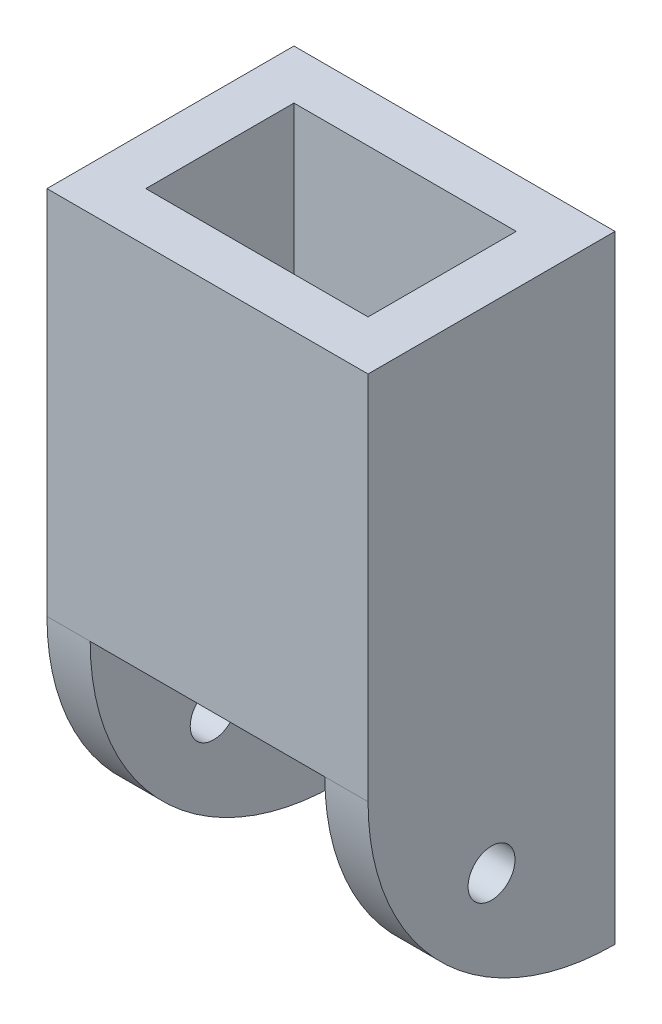
ISO-10303-21;
HEADER;
FILE_DESCRIPTION(('STEP AP214'),'2;1');
FILE_NAME('part.step','',(''),(''),'','','');
FILE_SCHEMA(('AUTOMOTIVE_DESIGN { 1 0 10303 214 1 1 1 1 }'));
ENDSEC;
DATA;
#1=APPLICATION_CONTEXT('core data for automotive mechanical design processes');
#2=APPLICATION_PROTOCOL_DEFINITION('international standard','automotive_design',2000,#1);
#3=PRODUCT_CONTEXT('',#1,'mechanical');
#4=PRODUCT('Part','Part','',(#3));
#5=PRODUCT_RELATED_PRODUCT_CATEGORY('part','',(#4));
#6=PRODUCT_DEFINITION_FORMATION('','',#4);
#7=PRODUCT_DEFINITION_CONTEXT('part definition',#1,'design');
#8=PRODUCT_DEFINITION('design','',#6,#7);
#9=PRODUCT_DEFINITION_SHAPE('','',#8);
#10=(LENGTH_UNIT() NAMED_UNIT(*) SI_UNIT(.MILLI.,.METRE.));
#11=(NAMED_UNIT(*) PLANE_ANGLE_UNIT() SI_UNIT($,.RADIAN.));
#12=(NAMED_UNIT(*) SI_UNIT($,.STERADIAN.) SOLID_ANGLE_UNIT());
#13=UNCERTAINTY_MEASURE_WITH_UNIT(LENGTH_MEASURE(1.E-05),#10,'distance_accuracy_value','');
#14=(GEOMETRIC_REPRESENTATION_CONTEXT(3) GLOBAL_UNCERTAINTY_ASSIGNED_CONTEXT((#13)) GLOBAL_UNIT_ASSIGNED_CONTEXT((#10,
#11,#12)) REPRESENTATION_CONTEXT('',''));
#15=CARTESIAN_POINT('',(0.,0.,0.));
#16=DIRECTION('',(0.,0.,1.));
#17=DIRECTION('',(1.,0.,0.));
#18=AXIS2_PLACEMENT_3D('',#15,#16,#17);
#19=CARTESIAN_POINT('',(0.,0.,0.));
#20=DIRECTION('',(0.,-1.,0.));
#21=DIRECTION('',(0.,0.,-1.));
#22=AXIS2_PLACEMENT_3D('',#19,#20,#21);
#23=PLANE('',#22);
#24=DIRECTION('',(0.,0.,1.));
#25=VECTOR('',#24,1.);
#26=CARTESIAN_POINT('',(4.,0.,3.6));
#27=LINE('',#26,#25);
#28=CARTESIAN_POINT('',(4.,0.,3.6));
#29=VERTEX_POINT('',#28);
#30=CARTESIAN_POINT('',(4.,0.,4.4));
#31=VERTEX_POINT('',#30);
#32=EDGE_CURVE('E67',#29,#31,#27,.T.);
#33=ORIENTED_EDGE('',*,*,#32,.F.);
#34=DIRECTION('',(1.,0.,0.));
#35=VECTOR('',#34,1.);
#36=CARTESIAN_POINT('',(-4.,0.,3.6));
#37=LINE('',#36,#35);
#38=CARTESIAN_POINT('',(-4.,0.,3.6));
#39=VERTEX_POINT('',#38);
#40=EDGE_CURVE('E230',#39,#29,#37,.T.);
#41=ORIENTED_EDGE('',*,*,#40,.F.);
#42=DIRECTION('',(0.,0.,-1.));
#43=VECTOR('',#42,1.);
#44=CARTESIAN_POINT('',(-4.,0.,3.6));
#45=LINE('',#44,#43);
#46=CARTESIAN_POINT('',(-4.,0.,4.4));
#47=VERTEX_POINT('',#46);
#48=EDGE_CURVE('E249',#47,#39,#45,.T.);
#49=ORIENTED_EDGE('',*,*,#48,.F.);
#50=DIRECTION('',(-1.,0.,0.));
#51=VECTOR('',#50,1.);
#52=CARTESIAN_POINT('',(-4.,0.,4.4));
#53=LINE('',#52,#51);
#54=EDGE_CURVE('E245',#31,#47,#53,.T.);
#55=ORIENTED_EDGE('',*,*,#54,.F.);
#56=EDGE_LOOP('',(#33,#41,#49,#55));
#57=FACE_BOUND('',#56,.T.);
#58=DIRECTION('',(1.,0.,0.));
#59=VECTOR('',#58,1.);
#60=CARTESIAN_POINT('',(-4.5,0.,3.));
#61=LINE('',#60,#59);
#62=CARTESIAN_POINT('',(-4.5,0.,3.));
#63=VERTEX_POINT('',#62);
#64=CARTESIAN_POINT('',(4.5,0.,3.));
#65=VERTEX_POINT('',#64);
#66=EDGE_CURVE('E329',#63,#65,#61,.T.);
#67=ORIENTED_EDGE('',*,*,#66,.T.);
#68=DIRECTION('',(0.,0.,1.));
#69=VECTOR('',#68,1.);
#70=CARTESIAN_POINT('',(4.5,0.,-5.));
#71=LINE('',#70,#69);
#72=CARTESIAN_POINT('',(4.5,0.,-3.));
#73=VERTEX_POINT('',#72);
#74=EDGE_CURVE('E273',#73,#65,#71,.T.);
#75=ORIENTED_EDGE('',*,*,#74,.F.);
#76=DIRECTION('',(-1.,0.,0.));
#77=VECTOR('',#76,1.);
#78=CARTESIAN_POINT('',(-4.5,0.,-3.));
#79=LINE('',#78,#77);
#80=CARTESIAN_POINT('',(-4.5,0.,-3.));
#81=VERTEX_POINT('',#80);
#82=EDGE_CURVE('E320',#73,#81,#79,.T.);
#83=ORIENTED_EDGE('',*,*,#82,.T.);
#84=DIRECTION('',(0.,0.,1.));
#85=VECTOR('',#84,1.);
#86=CARTESIAN_POINT('',(-4.5,0.,-5.));
#87=LINE('',#86,#85);
#88=EDGE_CURVE('E272',#81,#63,#87,.T.);
#89=ORIENTED_EDGE('',*,*,#88,.T.);
#90=EDGE_LOOP('',(#67,#75,#83,#89));
#91=FACE_BOUND('',#90,.T.);
#92=DIRECTION('',(1.,0.,0.));
#93=VECTOR('',#92,1.);
#94=CARTESIAN_POINT('',(4.5,0.,5.));
#95=LINE('',#94,#93);
#96=CARTESIAN_POINT('',(-4.75,0.,5.));
#97=VERTEX_POINT('',#96);
#98=CARTESIAN_POINT('',(4.75,0.,5.));
#99=VERTEX_POINT('',#98);
#100=EDGE_CURVE('E321',#97,#99,#95,.T.);
#101=ORIENTED_EDGE('',*,*,#100,.F.);
#102=DIRECTION('',(0.,0.,1.));
#103=VECTOR('',#102,1.);
#104=CARTESIAN_POINT('',(-4.75,0.,-5.));
#105=LINE('',#104,#103);
#106=CARTESIAN_POINT('',(-4.75,0.,-5.));
#107=VERTEX_POINT('',#106);
#108=EDGE_CURVE('E274',#107,#97,#105,.T.);
#109=ORIENTED_EDGE('',*,*,#108,.F.);
#110=DIRECTION('',(-1.,0.,0.));
#111=VECTOR('',#110,1.);
#112=CARTESIAN_POINT('',(-6.5,0.,-5.));
#113=LINE('',#112,#111);
#114=CARTESIAN_POINT('',(4.75,0.,-5.));
#115=VERTEX_POINT('',#114);
#116=EDGE_CURVE('E361',#115,#107,#113,.T.);
#117=ORIENTED_EDGE('',*,*,#116,.F.);
#118=DIRECTION('',(0.,0.,1.));
#119=VECTOR('',#118,1.);
#120=CARTESIAN_POINT('',(4.75,0.,-5.));
#121=LINE('',#120,#119);
#122=EDGE_CURVE('E284',#115,#99,#121,.T.);
#123=ORIENTED_EDGE('',*,*,#122,.T.);
#124=EDGE_LOOP('',(#101,#109,#117,#123));
#125=FACE_BOUND('',#124,.T.);
#126=DIRECTION('',(1.,0.,0.));
#127=VECTOR('',#126,1.);
#128=CARTESIAN_POINT('',(-4.,0.,-3.6));
#129=LINE('',#128,#127);
#130=CARTESIAN_POINT('',(-4.,0.,-3.6));
#131=VERTEX_POINT('',#130);
#132=CARTESIAN_POINT('',(4.,0.,-3.6));
#133=VERTEX_POINT('',#132);
#134=EDGE_CURVE('E211',#131,#133,#129,.T.);
#135=ORIENTED_EDGE('',*,*,#134,.T.);
#136=DIRECTION('',(0.,0.,-1.));
#137=VECTOR('',#136,1.);
#138=CARTESIAN_POINT('',(4.,0.,-3.6));
#139=LINE('',#138,#137);
#140=CARTESIAN_POINT('',(4.,0.,-4.4));
#141=VERTEX_POINT('',#140);
#142=EDGE_CURVE('E59',#133,#141,#139,.T.);
#143=ORIENTED_EDGE('',*,*,#142,.T.);
#144=DIRECTION('',(-1.,0.,0.));
#145=VECTOR('',#144,1.);
#146=CARTESIAN_POINT('',(-4.,0.,-4.4));
#147=LINE('',#146,#145);
#148=CARTESIAN_POINT('',(-4.,0.,-4.4));
#149=VERTEX_POINT('',#148);
#150=EDGE_CURVE('E198',#141,#149,#147,.T.);
#151=ORIENTED_EDGE('',*,*,#150,.T.);
#152=DIRECTION('',(0.,0.,1.));
#153=VECTOR('',#152,1.);
#154=CARTESIAN_POINT('',(-4.,0.,-3.6));
#155=LINE('',#154,#153);
#156=EDGE_CURVE('E202',#149,#131,#155,.T.);
#157=ORIENTED_EDGE('',*,*,#156,.T.);
#158=EDGE_LOOP('',(#135,#143,#151,#157));
#159=FACE_BOUND('',#158,.T.);
#160=ADVANCED_FACE('F41',(#57,#91,#125,#159),#23,.T.);
#161=CARTESIAN_POINT('',(0.,15.,0.));
#162=DIRECTION('',(0.,-1.,0.));
#163=DIRECTION('',(0.,0.,-1.));
#164=AXIS2_PLACEMENT_3D('',#161,#162,#163);
#165=PLANE('',#164);
#166=DIRECTION('',(0.,0.,-1.));
#167=VECTOR('',#166,1.);
#168=CARTESIAN_POINT('',(6.5,15.,5.));
#169=LINE('',#168,#167);
#170=CARTESIAN_POINT('',(6.5,15.,5.));
#171=VERTEX_POINT('',#170);
#172=CARTESIAN_POINT('',(6.5,15.,-5.));
#173=VERTEX_POINT('',#172);
#174=EDGE_CURVE('E362',#171,#173,#169,.T.);
#175=ORIENTED_EDGE('',*,*,#174,.T.);
#176=DIRECTION('',(-1.,0.,0.));
#177=VECTOR('',#176,1.);
#178=CARTESIAN_POINT('',(-6.5,15.,-5.));
#179=LINE('',#178,#177);
#180=CARTESIAN_POINT('',(-6.5,15.,-5.));
#181=VERTEX_POINT('',#180);
#182=EDGE_CURVE('E366',#173,#181,#179,.T.);
#183=ORIENTED_EDGE('',*,*,#182,.T.);
#184=DIRECTION('',(0.,0.,1.));
#185=VECTOR('',#184,1.);
#186=CARTESIAN_POINT('',(-6.5,15.,5.));
#187=LINE('',#186,#185);
#188=CARTESIAN_POINT('',(-6.5,15.,5.));
#189=VERTEX_POINT('',#188);
#190=EDGE_CURVE('E370',#181,#189,#187,.T.);
#191=ORIENTED_EDGE('',*,*,#190,.T.);
#192=DIRECTION('',(1.,0.,0.));
#193=VECTOR('',#192,1.);
#194=CARTESIAN_POINT('',(-6.5,15.,5.));
#195=LINE('',#194,#193);
#196=EDGE_CURVE('E373',#189,#171,#195,.T.);
#197=ORIENTED_EDGE('',*,*,#196,.T.);
#198=EDGE_LOOP('',(#175,#183,#191,#197));
#199=FACE_BOUND('',#198,.T.);
#200=DIRECTION('',(0.,0.,-1.));
#201=VECTOR('',#200,1.);
#202=CARTESIAN_POINT('',(4.5,15.,3.));
#203=LINE('',#202,#201);
#204=CARTESIAN_POINT('',(4.5,15.,3.));
#205=VERTEX_POINT('',#204);
#206=CARTESIAN_POINT('',(4.5,15.,-3.));
#207=VERTEX_POINT('',#206);
#208=EDGE_CURVE('E325',#205,#207,#203,.T.);
#209=ORIENTED_EDGE('',*,*,#208,.F.);
#210=DIRECTION('',(1.,0.,0.));
#211=VECTOR('',#210,1.);
#212=CARTESIAN_POINT('',(-4.5,15.,3.));
#213=LINE('',#212,#211);
#214=CARTESIAN_POINT('',(-4.5,15.,3.));
#215=VERTEX_POINT('',#214);
#216=EDGE_CURVE('E336',#215,#205,#213,.T.);
#217=ORIENTED_EDGE('',*,*,#216,.F.);
#218=DIRECTION('',(0.,0.,1.));
#219=VECTOR('',#218,1.);
#220=CARTESIAN_POINT('',(-4.5,15.,3.));
#221=LINE('',#220,#219);
#222=CARTESIAN_POINT('',(-4.5,15.,-3.));
#223=VERTEX_POINT('',#222);
#224=EDGE_CURVE('E332',#223,#215,#221,.T.);
#225=ORIENTED_EDGE('',*,*,#224,.F.);
#226=DIRECTION('',(-1.,0.,0.));
#227=VECTOR('',#226,1.);
#228=CARTESIAN_POINT('',(-4.5,15.,-3.));
#229=LINE('',#228,#227);
#230=EDGE_CURVE('E328',#207,#223,#229,.T.);
#231=ORIENTED_EDGE('',*,*,#230,.F.);
#232=EDGE_LOOP('',(#209,#217,#225,#231));
#233=FACE_BOUND('',#232,.T.);
#234=ADVANCED_FACE('F412',(#199,#233),#165,.F.);
#235=CARTESIAN_POINT('',(6.5,15.,5.));
#236=DIRECTION('',(-1.,0.,0.));
#237=DIRECTION('',(0.,0.,1.));
#238=AXIS2_PLACEMENT_3D('',#235,#236,#237);
#239=PLANE('',#238);
#240=CARTESIAN_POINT('',(6.5,-5.,0.));
#241=DIRECTION('',(1.,0.,0.));
#242=DIRECTION('',(0.,0.,-1.));
#243=AXIS2_PLACEMENT_3D('',#240,#241,#242);
#244=CIRCLE('',#243,0.95);
#245=CARTESIAN_POINT('',(6.5,-5.,-0.949999999999999));
#246=VERTEX_POINT('',#245);
#247=EDGE_CURVE('E297',#246,#246,#244,.T.);
#248=ORIENTED_EDGE('',*,*,#247,.F.);
#249=EDGE_LOOP('',(#248));
#250=FACE_BOUND('',#249,.T.);
#251=DIRECTION('',(0.,-1.,0.));
#252=VECTOR('',#251,1.);
#253=CARTESIAN_POINT('',(6.5,15.,5.));
#254=LINE('',#253,#252);
#255=CARTESIAN_POINT('',(6.5,0.,5.));
#256=VERTEX_POINT('',#255);
#257=EDGE_CURVE('E376',#171,#256,#254,.T.);
#258=ORIENTED_EDGE('',*,*,#257,.T.);
#259=CARTESIAN_POINT('',(6.5,0.,-5.));
#260=DIRECTION('',(1.,0.,0.));
#261=DIRECTION('',(0.,0.,-1.));
#262=AXIS2_PLACEMENT_3D('',#259,#260,#261);
#263=CIRCLE('',#262,10.);
#264=CARTESIAN_POINT('',(6.5,-10.,-5.));
#265=VERTEX_POINT('',#264);
#266=EDGE_CURVE('E312',#256,#265,#263,.T.);
#267=ORIENTED_EDGE('',*,*,#266,.T.);
#268=DIRECTION('',(0.,-1.,0.));
#269=VECTOR('',#268,1.);
#270=CARTESIAN_POINT('',(6.5,15.,-5.));
#271=LINE('',#270,#269);
#272=EDGE_CURVE('E11',#173,#265,#271,.T.);
#273=ORIENTED_EDGE('',*,*,#272,.F.);
#274=ORIENTED_EDGE('',*,*,#174,.F.);
#275=EDGE_LOOP('',(#258,#267,#273,#274));
#276=FACE_BOUND('',#275,.T.);
#277=ADVANCED_FACE('F43',(#250,#276),#239,.F.);
#278=CARTESIAN_POINT('',(-6.5,15.,-5.));
#279=DIRECTION('',(0.,0.,1.));
#280=DIRECTION('',(1.,0.,0.));
#281=AXIS2_PLACEMENT_3D('',#278,#279,#280);
#282=PLANE('',#281);
#283=ORIENTED_EDGE('',*,*,#116,.T.);
#284=DIRECTION('',(0.,-1.,0.));
#285=VECTOR('',#284,1.);
#286=CARTESIAN_POINT('',(-4.75,-10.,-5.));
#287=LINE('',#286,#285);
#288=CARTESIAN_POINT('',(-4.75,-10.,-5.));
#289=VERTEX_POINT('',#288);
#290=EDGE_CURVE('E268',#107,#289,#287,.T.);
#291=ORIENTED_EDGE('',*,*,#290,.T.);
#292=DIRECTION('',(-1.,0.,0.));
#293=VECTOR('',#292,1.);
#294=CARTESIAN_POINT('',(-4.5,-10.,-5.));
#295=LINE('',#294,#293);
#296=CARTESIAN_POINT('',(-6.5,-10.,-5.));
#297=VERTEX_POINT('',#296);
#298=EDGE_CURVE('E309',#289,#297,#295,.T.);
#299=ORIENTED_EDGE('',*,*,#298,.T.);
#300=DIRECTION('',(0.,-1.,0.));
#301=VECTOR('',#300,1.);
#302=CARTESIAN_POINT('',(-6.5,15.,-5.));
#303=LINE('',#302,#301);
#304=EDGE_CURVE('E51',#181,#297,#303,.T.);
#305=ORIENTED_EDGE('',*,*,#304,.F.);
#306=ORIENTED_EDGE('',*,*,#182,.F.);
#307=ORIENTED_EDGE('',*,*,#272,.T.);
#308=DIRECTION('',(1.,0.,0.));
#309=VECTOR('',#308,1.);
#310=CARTESIAN_POINT('',(4.5,-10.,-5.));
#311=LINE('',#310,#309);
#312=CARTESIAN_POINT('',(4.75,-10.,-5.));
#313=VERTEX_POINT('',#312);
#314=EDGE_CURVE('E317',#313,#265,#311,.T.);
#315=ORIENTED_EDGE('',*,*,#314,.F.);
#316=DIRECTION('',(0.,1.,0.));
#317=VECTOR('',#316,1.);
#318=CARTESIAN_POINT('',(4.75,-10.,-5.));
#319=LINE('',#318,#317);
#320=EDGE_CURVE('E259',#313,#115,#319,.T.);
#321=ORIENTED_EDGE('',*,*,#320,.T.);
#322=EDGE_LOOP('',(#283,#291,#299,#305,#306,#307,#315,#321));
#323=FACE_BOUND('',#322,.T.);
#324=ADVANCED_FACE('F430',(#323),#282,.F.);
#325=CARTESIAN_POINT('',(-6.5,15.,5.));
#326=DIRECTION('',(1.,0.,0.));
#327=DIRECTION('',(0.,0.,-1.));
#328=AXIS2_PLACEMENT_3D('',#325,#326,#327);
#329=PLANE('',#328);
#330=CARTESIAN_POINT('',(-6.5,-5.,0.));
#331=DIRECTION('',(1.,0.,0.));
#332=DIRECTION('',(0.,0.,-1.));
#333=AXIS2_PLACEMENT_3D('',#330,#331,#332);
#334=CIRCLE('',#333,0.95);
#335=CARTESIAN_POINT('',(-6.5,-5.,-0.949999999999999));
#336=VERTEX_POINT('',#335);
#337=EDGE_CURVE('E298',#336,#336,#334,.T.);
#338=ORIENTED_EDGE('',*,*,#337,.T.);
#339=EDGE_LOOP('',(#338));
#340=FACE_BOUND('',#339,.T.);
#341=ORIENTED_EDGE('',*,*,#304,.T.);
#342=CARTESIAN_POINT('',(-6.5,0.,-5.));
#343=DIRECTION('',(1.,0.,0.));
#344=DIRECTION('',(0.,0.,-1.));
#345=AXIS2_PLACEMENT_3D('',#342,#343,#344);
#346=CIRCLE('',#345,10.);
#347=CARTESIAN_POINT('',(-6.5,0.,5.));
#348=VERTEX_POINT('',#347);
#349=EDGE_CURVE('E302',#348,#297,#346,.T.);
#350=ORIENTED_EDGE('',*,*,#349,.F.);
#351=DIRECTION('',(0.,-1.,0.));
#352=VECTOR('',#351,1.);
#353=CARTESIAN_POINT('',(-6.5,15.,5.));
#354=LINE('',#353,#352);
#355=EDGE_CURVE('E385',#189,#348,#354,.T.);
#356=ORIENTED_EDGE('',*,*,#355,.F.);
#357=ORIENTED_EDGE('',*,*,#190,.F.);
#358=EDGE_LOOP('',(#341,#350,#356,#357));
#359=FACE_BOUND('',#358,.T.);
#360=ADVANCED_FACE('F427',(#340,#359),#329,.F.);
#361=CARTESIAN_POINT('',(-6.5,15.,5.));
#362=DIRECTION('',(0.,0.,-1.));
#363=DIRECTION('',(-1.,0.,0.));
#364=AXIS2_PLACEMENT_3D('',#361,#362,#363);
#365=PLANE('',#364);
#366=DIRECTION('',(1.,0.,0.));
#367=VECTOR('',#366,1.);
#368=CARTESIAN_POINT('',(-6.5,0.,5.));
#369=LINE('',#368,#367);
#370=EDGE_CURVE('E367',#348,#97,#369,.T.);
#371=ORIENTED_EDGE('',*,*,#370,.T.);
#372=ORIENTED_EDGE('',*,*,#100,.T.);
#373=EDGE_CURVE('E316',#99,#256,#95,.T.);
#374=ORIENTED_EDGE('',*,*,#373,.T.);
#375=ORIENTED_EDGE('',*,*,#257,.F.);
#376=ORIENTED_EDGE('',*,*,#196,.F.);
#377=ORIENTED_EDGE('',*,*,#355,.T.);
#378=EDGE_LOOP('',(#371,#372,#374,#375,#376,#377));
#379=FACE_BOUND('',#378,.T.);
#380=ADVANCED_FACE('F423',(#379),#365,.F.);
#381=CARTESIAN_POINT('',(4.5,15.,3.));
#382=DIRECTION('',(-1.,0.,0.));
#383=DIRECTION('',(0.,0.,1.));
#384=AXIS2_PLACEMENT_3D('',#381,#382,#383);
#385=PLANE('',#384);
#386=ORIENTED_EDGE('',*,*,#74,.T.);
#387=DIRECTION('',(0.,-1.,0.));
#388=VECTOR('',#387,1.);
#389=CARTESIAN_POINT('',(4.5,15.,3.));
#390=LINE('',#389,#388);
#391=EDGE_CURVE('E339',#205,#65,#390,.T.);
#392=ORIENTED_EDGE('',*,*,#391,.F.);
#393=ORIENTED_EDGE('',*,*,#208,.T.);
#394=DIRECTION('',(0.,-1.,0.));
#395=VECTOR('',#394,1.);
#396=CARTESIAN_POINT('',(4.5,15.,-3.));
#397=LINE('',#396,#395);
#398=EDGE_CURVE('E357',#207,#73,#397,.T.);
#399=ORIENTED_EDGE('',*,*,#398,.T.);
#400=EDGE_LOOP('',(#386,#392,#393,#399));
#401=FACE_BOUND('',#400,.T.);
#402=ADVANCED_FACE('F426',(#401),#385,.T.);
#403=CARTESIAN_POINT('',(-4.5,15.,-3.));
#404=DIRECTION('',(0.,0.,1.));
#405=DIRECTION('',(1.,0.,0.));
#406=AXIS2_PLACEMENT_3D('',#403,#404,#405);
#407=PLANE('',#406);
#408=ORIENTED_EDGE('',*,*,#82,.F.);
#409=ORIENTED_EDGE('',*,*,#398,.F.);
#410=ORIENTED_EDGE('',*,*,#230,.T.);
#411=DIRECTION('',(0.,-1.,0.));
#412=VECTOR('',#411,1.);
#413=CARTESIAN_POINT('',(-4.5,15.,-3.));
#414=LINE('',#413,#412);
#415=EDGE_CURVE('E353',#223,#81,#414,.T.);
#416=ORIENTED_EDGE('',*,*,#415,.T.);
#417=EDGE_LOOP('',(#408,#409,#410,#416));
#418=FACE_BOUND('',#417,.T.);
#419=ADVANCED_FACE('F487',(#418),#407,.T.);
#420=CARTESIAN_POINT('',(-4.5,15.,3.));
#421=DIRECTION('',(1.,0.,0.));
#422=DIRECTION('',(0.,0.,-1.));
#423=AXIS2_PLACEMENT_3D('',#420,#421,#422);
#424=PLANE('',#423);
#425=ORIENTED_EDGE('',*,*,#88,.F.);
#426=ORIENTED_EDGE('',*,*,#415,.F.);
#427=ORIENTED_EDGE('',*,*,#224,.T.);
#428=DIRECTION('',(0.,-1.,0.));
#429=VECTOR('',#428,1.);
#430=CARTESIAN_POINT('',(-4.5,15.,3.));
#431=LINE('',#430,#429);
#432=EDGE_CURVE('E349',#215,#63,#431,.T.);
#433=ORIENTED_EDGE('',*,*,#432,.T.);
#434=EDGE_LOOP('',(#425,#426,#427,#433));
#435=FACE_BOUND('',#434,.T.);
#436=ADVANCED_FACE('F483',(#435),#424,.T.);
#437=CARTESIAN_POINT('',(-4.5,15.,3.));
#438=DIRECTION('',(0.,0.,-1.));
#439=DIRECTION('',(-1.,0.,0.));
#440=AXIS2_PLACEMENT_3D('',#437,#438,#439);
#441=PLANE('',#440);
#442=ORIENTED_EDGE('',*,*,#66,.F.);
#443=ORIENTED_EDGE('',*,*,#432,.F.);
#444=ORIENTED_EDGE('',*,*,#216,.T.);
#445=ORIENTED_EDGE('',*,*,#391,.T.);
#446=EDGE_LOOP('',(#442,#443,#444,#445));
#447=FACE_BOUND('',#446,.T.);
#448=ADVANCED_FACE('F480',(#447),#441,.T.);
#449=CARTESIAN_POINT('',(4.5,0.,-5.));
#450=DIRECTION('',(1.,0.,0.));
#451=DIRECTION('',(0.,0.,-1.));
#452=AXIS2_PLACEMENT_3D('',#449,#450,#451);
#453=CYLINDRICAL_SURFACE('',#452,10.);
#454=CARTESIAN_POINT('',(4.75,0.,-5.));
#455=DIRECTION('',(1.,0.,0.));
#456=DIRECTION('',(0.,0.,-1.));
#457=AXIS2_PLACEMENT_3D('',#454,#455,#456);
#458=CIRCLE('',#457,10.);
#459=EDGE_CURVE('E289',#313,#99,#458,.F.);
#460=ORIENTED_EDGE('',*,*,#459,.F.);
#461=ORIENTED_EDGE('',*,*,#314,.T.);
#462=ORIENTED_EDGE('',*,*,#266,.F.);
#463=ORIENTED_EDGE('',*,*,#373,.F.);
#464=EDGE_LOOP('',(#460,#461,#462,#463));
#465=FACE_BOUND('',#464,.T.);
#466=ADVANCED_FACE('F464',(#465),#453,.T.);
#467=CARTESIAN_POINT('',(-4.5,0.,-5.));
#468=DIRECTION('',(-1.,0.,0.));
#469=DIRECTION('',(0.,0.,1.));
#470=AXIS2_PLACEMENT_3D('',#467,#468,#469);
#471=CYLINDRICAL_SURFACE('',#470,10.);
#472=ORIENTED_EDGE('',*,*,#298,.F.);
#473=CARTESIAN_POINT('',(-4.75,0.,-5.));
#474=DIRECTION('',(-1.,0.,0.));
#475=DIRECTION('',(0.,0.,1.));
#476=AXIS2_PLACEMENT_3D('',#473,#474,#475);
#477=CIRCLE('',#476,10.);
#478=EDGE_CURVE('E293',#289,#97,#477,.T.);
#479=ORIENTED_EDGE('',*,*,#478,.T.);
#480=ORIENTED_EDGE('',*,*,#370,.F.);
#481=ORIENTED_EDGE('',*,*,#349,.T.);
#482=EDGE_LOOP('',(#472,#479,#480,#481));
#483=FACE_BOUND('',#482,.T.);
#484=ADVANCED_FACE('F448',(#483),#471,.T.);
#485=CARTESIAN_POINT('',(-6.5,-5.,0.));
#486=DIRECTION('',(1.,0.,0.));
#487=DIRECTION('',(0.,0.,-1.));
#488=AXIS2_PLACEMENT_3D('',#485,#486,#487);
#489=CYLINDRICAL_SURFACE('',#488,0.95);
#490=CARTESIAN_POINT('',(-4.75,-5.,0.));
#491=DIRECTION('',(-1.,0.,0.));
#492=DIRECTION('',(0.,0.,1.));
#493=AXIS2_PLACEMENT_3D('',#490,#491,#492);
#494=CIRCLE('',#493,0.95);
#495=CARTESIAN_POINT('',(-4.75,-5.,0.950000000000001));
#496=VERTEX_POINT('',#495);
#497=EDGE_CURVE('E45',#496,#496,#494,.F.);
#498=ORIENTED_EDGE('',*,*,#497,.T.);
#499=EDGE_LOOP('',(#498));
#500=FACE_BOUND('',#499,.T.);
#501=ORIENTED_EDGE('',*,*,#337,.F.);
#502=EDGE_LOOP('',(#501));
#503=FACE_BOUND('',#502,.T.);
#504=ADVANCED_FACE('F409',(#500,#503),#489,.F.);
#505=CARTESIAN_POINT('',(4.75,-5.,0.));
#506=DIRECTION('',(1.,0.,0.));
#507=DIRECTION('',(0.,0.,-1.));
#508=AXIS2_PLACEMENT_3D('',#505,#506,#507);
#509=CIRCLE('',#508,0.95);
#510=CARTESIAN_POINT('',(4.75,-5.,-0.949999999999999));
#511=VERTEX_POINT('',#510);
#512=EDGE_CURVE('E278',#511,#511,#509,.F.);
#513=ORIENTED_EDGE('',*,*,#512,.T.);
#514=EDGE_LOOP('',(#513));
#515=FACE_BOUND('',#514,.T.);
#516=ORIENTED_EDGE('',*,*,#247,.T.);
#517=EDGE_LOOP('',(#516));
#518=FACE_BOUND('',#517,.T.);
#519=ADVANCED_FACE('F394',(#515,#518),#489,.F.);
#520=CARTESIAN_POINT('',(4.75,-10.,-5.));
#521=DIRECTION('',(1.,0.,0.));
#522=DIRECTION('',(0.,0.,-1.));
#523=AXIS2_PLACEMENT_3D('',#520,#521,#522);
#524=PLANE('',#523);
#525=ORIENTED_EDGE('',*,*,#459,.T.);
#526=ORIENTED_EDGE('',*,*,#122,.F.);
#527=ORIENTED_EDGE('',*,*,#320,.F.);
#528=EDGE_LOOP('',(#525,#526,#527));
#529=FACE_BOUND('',#528,.T.);
#530=ORIENTED_EDGE('',*,*,#512,.F.);
#531=EDGE_LOOP('',(#530));
#532=FACE_BOUND('',#531,.T.);
#533=ADVANCED_FACE('F397',(#529,#532),#524,.F.);
#534=CARTESIAN_POINT('',(-4.75,-10.,-5.));
#535=DIRECTION('',(-1.,0.,0.));
#536=DIRECTION('',(0.,0.,1.));
#537=AXIS2_PLACEMENT_3D('',#534,#535,#536);
#538=PLANE('',#537);
#539=ORIENTED_EDGE('',*,*,#497,.F.);
#540=EDGE_LOOP('',(#539));
#541=FACE_BOUND('',#540,.T.);
#542=ORIENTED_EDGE('',*,*,#290,.F.);
#543=ORIENTED_EDGE('',*,*,#108,.T.);
#544=ORIENTED_EDGE('',*,*,#478,.F.);
#545=EDGE_LOOP('',(#542,#543,#544));
#546=FACE_BOUND('',#545,.T.);
#547=ADVANCED_FACE('F399',(#541,#546),#538,.F.);
#548=CARTESIAN_POINT('',(4.,10.,3.6));
#549=DIRECTION('',(1.,0.,0.));
#550=DIRECTION('',(0.,0.,-1.));
#551=AXIS2_PLACEMENT_3D('',#548,#549,#550);
#552=PLANE('',#551);
#553=ORIENTED_EDGE('',*,*,#32,.T.);
#554=DIRECTION('',(0.,-1.,0.));
#555=VECTOR('',#554,1.);
#556=CARTESIAN_POINT('',(4.,10.,4.4));
#557=LINE('',#556,#555);
#558=CARTESIAN_POINT('',(4.,10.,4.4));
#559=VERTEX_POINT('',#558);
#560=EDGE_CURVE('E242',#559,#31,#557,.T.);
#561=ORIENTED_EDGE('',*,*,#560,.F.);
#562=DIRECTION('',(0.,0.,1.));
#563=VECTOR('',#562,1.);
#564=CARTESIAN_POINT('',(4.,10.,3.6));
#565=LINE('',#564,#563);
#566=CARTESIAN_POINT('',(4.,10.,3.6));
#567=VERTEX_POINT('',#566);
#568=EDGE_CURVE('E225',#567,#559,#565,.T.);
#569=ORIENTED_EDGE('',*,*,#568,.F.);
#570=DIRECTION('',(0.,-1.,0.));
#571=VECTOR('',#570,1.);
#572=CARTESIAN_POINT('',(4.,10.,3.6));
#573=LINE('',#572,#571);
#574=EDGE_CURVE('E256',#567,#29,#573,.T.);
#575=ORIENTED_EDGE('',*,*,#574,.T.);
#576=EDGE_LOOP('',(#553,#561,#569,#575));
#577=FACE_BOUND('',#576,.T.);
#578=ADVANCED_FACE('F406',(#577),#552,.F.);
#579=CARTESIAN_POINT('',(-4.,10.,3.6));
#580=DIRECTION('',(0.,0.,-1.));
#581=DIRECTION('',(-1.,0.,0.));
#582=AXIS2_PLACEMENT_3D('',#579,#580,#581);
#583=PLANE('',#582);
#584=ORIENTED_EDGE('',*,*,#40,.T.);
#585=ORIENTED_EDGE('',*,*,#574,.F.);
#586=DIRECTION('',(1.,0.,0.));
#587=VECTOR('',#586,1.);
#588=CARTESIAN_POINT('',(-4.,10.,3.6));
#589=LINE('',#588,#587);
#590=CARTESIAN_POINT('',(-4.,10.,3.6));
#591=VERTEX_POINT('',#590);
#592=EDGE_CURVE('E238',#591,#567,#589,.T.);
#593=ORIENTED_EDGE('',*,*,#592,.F.);
#594=DIRECTION('',(0.,-1.,0.));
#595=VECTOR('',#594,1.);
#596=CARTESIAN_POINT('',(-4.,10.,3.6));
#597=LINE('',#596,#595);
#598=EDGE_CURVE('E260',#591,#39,#597,.T.);
#599=ORIENTED_EDGE('',*,*,#598,.T.);
#600=EDGE_LOOP('',(#584,#585,#593,#599));
#601=FACE_BOUND('',#600,.T.);
#602=ADVANCED_FACE('F555',(#601),#583,.F.);
#603=CARTESIAN_POINT('',(-4.,10.,3.6));
#604=DIRECTION('',(-1.,0.,0.));
#605=DIRECTION('',(0.,0.,1.));
#606=AXIS2_PLACEMENT_3D('',#603,#604,#605);
#607=PLANE('',#606);
#608=ORIENTED_EDGE('',*,*,#48,.T.);
#609=ORIENTED_EDGE('',*,*,#598,.F.);
#610=DIRECTION('',(0.,0.,-1.));
#611=VECTOR('',#610,1.);
#612=CARTESIAN_POINT('',(-4.,10.,3.6));
#613=LINE('',#612,#611);
#614=CARTESIAN_POINT('',(-4.,10.,4.4));
#615=VERTEX_POINT('',#614);
#616=EDGE_CURVE('E234',#615,#591,#613,.T.);
#617=ORIENTED_EDGE('',*,*,#616,.F.);
#618=DIRECTION('',(0.,-1.,0.));
#619=VECTOR('',#618,1.);
#620=CARTESIAN_POINT('',(-4.,10.,4.4));
#621=LINE('',#620,#619);
#622=EDGE_CURVE('E263',#615,#47,#621,.T.);
#623=ORIENTED_EDGE('',*,*,#622,.T.);
#624=EDGE_LOOP('',(#608,#609,#617,#623));
#625=FACE_BOUND('',#624,.T.);
#626=ADVANCED_FACE('F564',(#625),#607,.F.);
#627=CARTESIAN_POINT('',(-4.,10.,4.4));
#628=DIRECTION('',(0.,0.,1.));
#629=DIRECTION('',(1.,0.,0.));
#630=AXIS2_PLACEMENT_3D('',#627,#628,#629);
#631=PLANE('',#630);
#632=ORIENTED_EDGE('',*,*,#54,.T.);
#633=ORIENTED_EDGE('',*,*,#622,.F.);
#634=DIRECTION('',(-1.,0.,0.));
#635=VECTOR('',#634,1.);
#636=CARTESIAN_POINT('',(-4.,10.,4.4));
#637=LINE('',#636,#635);
#638=EDGE_CURVE('E229',#559,#615,#637,.T.);
#639=ORIENTED_EDGE('',*,*,#638,.F.);
#640=ORIENTED_EDGE('',*,*,#560,.T.);
#641=EDGE_LOOP('',(#632,#633,#639,#640));
#642=FACE_BOUND('',#641,.T.);
#643=ADVANCED_FACE('F574',(#642),#631,.F.);
#644=CARTESIAN_POINT('',(0.,10.,0.));
#645=DIRECTION('',(0.,1.,0.));
#646=DIRECTION('',(0.,0.,1.));
#647=AXIS2_PLACEMENT_3D('',#644,#645,#646);
#648=PLANE('',#647);
#649=ORIENTED_EDGE('',*,*,#568,.T.);
#650=ORIENTED_EDGE('',*,*,#638,.T.);
#651=ORIENTED_EDGE('',*,*,#616,.T.);
#652=ORIENTED_EDGE('',*,*,#592,.T.);
#653=EDGE_LOOP('',(#649,#650,#651,#652));
#654=FACE_BOUND('',#653,.T.);
#655=ADVANCED_FACE('F584',(#654),#648,.F.);
#656=CARTESIAN_POINT('',(4.,10.,-3.6));
#657=DIRECTION('',(-1.,0.,0.));
#658=DIRECTION('',(0.,0.,1.));
#659=AXIS2_PLACEMENT_3D('',#656,#657,#658);
#660=PLANE('',#659);
#661=ORIENTED_EDGE('',*,*,#142,.F.);
#662=DIRECTION('',(0.,-1.,0.));
#663=VECTOR('',#662,1.);
#664=CARTESIAN_POINT('',(4.,10.,-3.6));
#665=LINE('',#664,#663);
#666=CARTESIAN_POINT('',(4.,10.,-3.6));
#667=VERTEX_POINT('',#666);
#668=EDGE_CURVE('E180',#667,#133,#665,.T.);
#669=ORIENTED_EDGE('',*,*,#668,.F.);
#670=DIRECTION('',(0.,0.,-1.));
#671=VECTOR('',#670,1.);
#672=CARTESIAN_POINT('',(4.,10.,-3.6));
#673=LINE('',#672,#671);
#674=CARTESIAN_POINT('',(4.,10.,-4.4));
#675=VERTEX_POINT('',#674);
#676=EDGE_CURVE('E188',#667,#675,#673,.T.);
#677=ORIENTED_EDGE('',*,*,#676,.T.);
#678=DIRECTION('',(0.,-1.,0.));
#679=VECTOR('',#678,1.);
#680=CARTESIAN_POINT('',(4.,10.,-4.4));
#681=LINE('',#680,#679);
#682=EDGE_CURVE('E217',#675,#141,#681,.T.);
#683=ORIENTED_EDGE('',*,*,#682,.T.);
#684=EDGE_LOOP('',(#661,#669,#677,#683));
#685=FACE_BOUND('',#684,.T.);
#686=ADVANCED_FACE('F191',(#685),#660,.T.);
#687=CARTESIAN_POINT('',(-4.,10.,-4.4));
#688=DIRECTION('',(0.,0.,1.));
#689=DIRECTION('',(1.,0.,0.));
#690=AXIS2_PLACEMENT_3D('',#687,#688,#689);
#691=PLANE('',#690);
#692=ORIENTED_EDGE('',*,*,#150,.F.);
#693=ORIENTED_EDGE('',*,*,#682,.F.);
#694=DIRECTION('',(-1.,0.,0.));
#695=VECTOR('',#694,1.);
#696=CARTESIAN_POINT('',(-4.,10.,-4.4));
#697=LINE('',#696,#695);
#698=CARTESIAN_POINT('',(-4.,10.,-4.4));
#699=VERTEX_POINT('',#698);
#700=EDGE_CURVE('E194',#675,#699,#697,.T.);
#701=ORIENTED_EDGE('',*,*,#700,.T.);
#702=DIRECTION('',(0.,-1.,0.));
#703=VECTOR('',#702,1.);
#704=CARTESIAN_POINT('',(-4.,10.,-4.4));
#705=LINE('',#704,#703);
#706=EDGE_CURVE('E220',#699,#149,#705,.T.);
#707=ORIENTED_EDGE('',*,*,#706,.T.);
#708=EDGE_LOOP('',(#692,#693,#701,#707));
#709=FACE_BOUND('',#708,.T.);
#710=ADVANCED_FACE('F609',(#709),#691,.T.);
#711=CARTESIAN_POINT('',(-4.,10.,-3.6));
#712=DIRECTION('',(1.,0.,0.));
#713=DIRECTION('',(0.,0.,-1.));
#714=AXIS2_PLACEMENT_3D('',#711,#712,#713);
#715=PLANE('',#714);
#716=ORIENTED_EDGE('',*,*,#156,.F.);
#717=ORIENTED_EDGE('',*,*,#706,.F.);
#718=DIRECTION('',(0.,0.,1.));
#719=VECTOR('',#718,1.);
#720=CARTESIAN_POINT('',(-4.,10.,-3.6));
#721=LINE('',#720,#719);
#722=CARTESIAN_POINT('',(-4.,10.,-3.6));
#723=VERTEX_POINT('',#722);
#724=EDGE_CURVE('E187',#699,#723,#721,.T.);
#725=ORIENTED_EDGE('',*,*,#724,.T.);
#726=DIRECTION('',(0.,-1.,0.));
#727=VECTOR('',#726,1.);
#728=CARTESIAN_POINT('',(-4.,10.,-3.6));
#729=LINE('',#728,#727);
#730=EDGE_CURVE('E182',#723,#131,#729,.T.);
#731=ORIENTED_EDGE('',*,*,#730,.T.);
#732=EDGE_LOOP('',(#716,#717,#725,#731));
#733=FACE_BOUND('',#732,.T.);
#734=ADVANCED_FACE('F618',(#733),#715,.T.);
#735=CARTESIAN_POINT('',(-4.,10.,-3.6));
#736=DIRECTION('',(0.,0.,-1.));
#737=DIRECTION('',(-1.,0.,0.));
#738=AXIS2_PLACEMENT_3D('',#735,#736,#737);
#739=PLANE('',#738);
#740=ORIENTED_EDGE('',*,*,#134,.F.);
#741=ORIENTED_EDGE('',*,*,#730,.F.);
#742=DIRECTION('',(1.,0.,0.));
#743=VECTOR('',#742,1.);
#744=CARTESIAN_POINT('',(-4.,10.,-3.6));
#745=LINE('',#744,#743);
#746=EDGE_CURVE('E177',#723,#667,#745,.T.);
#747=ORIENTED_EDGE('',*,*,#746,.T.);
#748=ORIENTED_EDGE('',*,*,#668,.T.);
#749=EDGE_LOOP('',(#740,#741,#747,#748));
#750=FACE_BOUND('',#749,.T.);
#751=ADVANCED_FACE('F179',(#750),#739,.T.);
#752=CARTESIAN_POINT('',(0.,10.,0.));
#753=DIRECTION('',(0.,1.,0.));
#754=DIRECTION('',(0.,0.,-1.));
#755=AXIS2_PLACEMENT_3D('',#752,#753,#754);
#756=PLANE('',#755);
#757=ORIENTED_EDGE('',*,*,#676,.F.);
#758=ORIENTED_EDGE('',*,*,#746,.F.);
#759=ORIENTED_EDGE('',*,*,#724,.F.);
#760=ORIENTED_EDGE('',*,*,#700,.F.);
#761=EDGE_LOOP('',(#757,#758,#759,#760));
#762=FACE_BOUND('',#761,.T.);
#763=ADVANCED_FACE('F196',(#762),#756,.F.);
#764=CLOSED_SHELL('',(#160,#234,#277,#324,#360,#380,#402,#419,#436,#448,#466,#484,#504,#519,
#533,#547,#578,#602,#626,#643,#655,#686,#710,#734,#751,#763));
#765=MANIFOLD_SOLID_BREP('B2',#764);
#766=ADVANCED_BREP_SHAPE_REPRESENTATION('',(#18,#765),#14);
#767=SHAPE_DEFINITION_REPRESENTATION(#9,#766);
ENDSEC;
END-ISO-10303-21;
